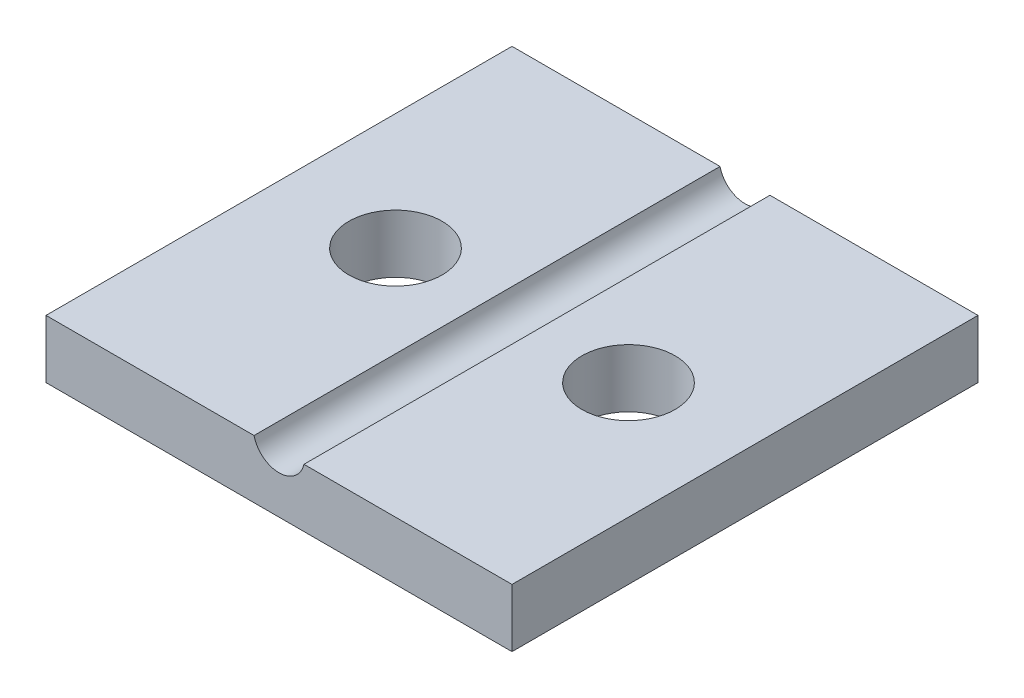
ISO-10303-21;
HEADER;
FILE_DESCRIPTION(('STEP AP214'),'2;1');
FILE_NAME('part.step','',(''),(''),'','','');
FILE_SCHEMA(('AUTOMOTIVE_DESIGN { 1 0 10303 214 1 1 1 1 }'));
ENDSEC;
DATA;
#1=APPLICATION_CONTEXT('core data for automotive mechanical design processes');
#2=APPLICATION_PROTOCOL_DEFINITION('international standard','automotive_design',2000,#1);
#3=PRODUCT_CONTEXT('',#1,'mechanical');
#4=PRODUCT('Part','Part','',(#3));
#5=PRODUCT_RELATED_PRODUCT_CATEGORY('part','',(#4));
#6=PRODUCT_DEFINITION_FORMATION('','',#4);
#7=PRODUCT_DEFINITION_CONTEXT('part definition',#1,'design');
#8=PRODUCT_DEFINITION('design','',#6,#7);
#9=PRODUCT_DEFINITION_SHAPE('','',#8);
#10=(LENGTH_UNIT() NAMED_UNIT(*) SI_UNIT(.MILLI.,.METRE.));
#11=(NAMED_UNIT(*) PLANE_ANGLE_UNIT() SI_UNIT($,.RADIAN.));
#12=(NAMED_UNIT(*) SI_UNIT($,.STERADIAN.) SOLID_ANGLE_UNIT());
#13=UNCERTAINTY_MEASURE_WITH_UNIT(LENGTH_MEASURE(1.E-05),#10,'distance_accuracy_value','');
#14=(GEOMETRIC_REPRESENTATION_CONTEXT(3) GLOBAL_UNCERTAINTY_ASSIGNED_CONTEXT((#13)) GLOBAL_UNIT_ASSIGNED_CONTEXT((#10,
#11,#12)) REPRESENTATION_CONTEXT('',''));
#15=CARTESIAN_POINT('',(0.,0.,0.));
#16=DIRECTION('',(0.,0.,1.));
#17=DIRECTION('',(1.,0.,0.));
#18=AXIS2_PLACEMENT_3D('',#15,#16,#17);
#19=CARTESIAN_POINT('',(0.,2.5,0.));
#20=DIRECTION('',(0.,1.,0.));
#21=DIRECTION('',(0.,0.,1.));
#22=AXIS2_PLACEMENT_3D('',#19,#20,#21);
#23=PLANE('',#22);
#24=CARTESIAN_POINT('',(-55.7547169811321,2.5,-42.0754716981132));
#25=DIRECTION('',(0.,1.,0.));
#26=DIRECTION('',(0.,0.,1.));
#27=AXIS2_PLACEMENT_3D('',#24,#25,#26);
#28=CIRCLE('',#27,2.);
#29=CARTESIAN_POINT('',(-55.7547169811321,2.5,-40.0754716981132));
#30=VERTEX_POINT('',#29);
#31=EDGE_CURVE('E170',#30,#30,#28,.T.);
#32=ORIENTED_EDGE('',*,*,#31,.F.);
#33=EDGE_LOOP('',(#32));
#34=FACE_BOUND('',#33,.T.);
#35=DIRECTION('',(0.,0.,1.));
#36=VECTOR('',#35,1.);
#37=CARTESIAN_POINT('',(-51.8259312454135,2.5,-52.0754716981132));
#38=LINE('',#37,#36);
#39=CARTESIAN_POINT('',(-51.8259312454135,2.5,-52.0754716981132));
#40=VERTEX_POINT('',#39);
#41=CARTESIAN_POINT('',(-51.8259312454135,2.5,-32.0754716981132));
#42=VERTEX_POINT('',#41);
#43=EDGE_CURVE('E11',#40,#42,#38,.T.);
#44=ORIENTED_EDGE('',*,*,#43,.F.);
#45=DIRECTION('',(-1.,0.,0.));
#46=VECTOR('',#45,1.);
#47=CARTESIAN_POINT('',(-60.7547169811321,2.5,-52.0754716981132));
#48=LINE('',#47,#46);
#49=CARTESIAN_POINT('',(-60.7547169811321,2.5,-52.0754716981132));
#50=VERTEX_POINT('',#49);
#51=EDGE_CURVE('E56',#40,#50,#48,.T.);
#52=ORIENTED_EDGE('',*,*,#51,.T.);
#53=DIRECTION('',(0.,0.,1.));
#54=VECTOR('',#53,1.);
#55=CARTESIAN_POINT('',(-60.7547169811321,2.5,-52.0754716981132));
#56=LINE('',#55,#54);
#57=CARTESIAN_POINT('',(-60.7547169811321,2.5,-32.0754716981132));
#58=VERTEX_POINT('',#57);
#59=EDGE_CURVE('E103',#50,#58,#56,.T.);
#60=ORIENTED_EDGE('',*,*,#59,.T.);
#61=DIRECTION('',(1.,0.,0.));
#62=VECTOR('',#61,1.);
#63=CARTESIAN_POINT('',(-60.7547169811321,2.5,-32.0754716981132));
#64=LINE('',#63,#62);
#65=EDGE_CURVE('E85',#58,#42,#64,.T.);
#66=ORIENTED_EDGE('',*,*,#65,.T.);
#67=EDGE_LOOP('',(#44,#52,#60,#66));
#68=FACE_BOUND('',#67,.T.);
#69=ADVANCED_FACE('F33',(#34,#68),#23,.T.);
#70=CARTESIAN_POINT('',(-60.7547169811321,2.5,-52.0754716981132));
#71=DIRECTION('',(1.,0.,0.));
#72=DIRECTION('',(0.,0.,-1.));
#73=AXIS2_PLACEMENT_3D('',#70,#71,#72);
#74=PLANE('',#73);
#75=DIRECTION('',(0.,0.,1.));
#76=VECTOR('',#75,1.);
#77=CARTESIAN_POINT('',(-60.7547169811321,0.,-52.0754716981132));
#78=LINE('',#77,#76);
#79=CARTESIAN_POINT('',(-60.7547169811321,0.,-52.0754716981132));
#80=VERTEX_POINT('',#79);
#81=CARTESIAN_POINT('',(-60.7547169811321,0.,-32.0754716981132));
#82=VERTEX_POINT('',#81);
#83=EDGE_CURVE('E114',#80,#82,#78,.T.);
#84=ORIENTED_EDGE('',*,*,#83,.T.);
#85=DIRECTION('',(0.,-1.,0.));
#86=VECTOR('',#85,1.);
#87=CARTESIAN_POINT('',(-60.7547169811321,2.5,-32.0754716981132));
#88=LINE('',#87,#86);
#89=EDGE_CURVE('E128',#58,#82,#88,.T.);
#90=ORIENTED_EDGE('',*,*,#89,.F.);
#91=ORIENTED_EDGE('',*,*,#59,.F.);
#92=DIRECTION('',(0.,-1.,0.));
#93=VECTOR('',#92,1.);
#94=CARTESIAN_POINT('',(-60.7547169811321,2.5,-52.0754716981132));
#95=LINE('',#94,#93);
#96=EDGE_CURVE('E113',#50,#80,#95,.T.);
#97=ORIENTED_EDGE('',*,*,#96,.T.);
#98=EDGE_LOOP('',(#84,#90,#91,#97));
#99=FACE_BOUND('',#98,.T.);
#100=ADVANCED_FACE('F35',(#99),#74,.F.);
#101=CARTESIAN_POINT('',(-60.7547169811321,2.5,-32.0754716981132));
#102=DIRECTION('',(0.,0.,-1.));
#103=DIRECTION('',(-1.,0.,0.));
#104=AXIS2_PLACEMENT_3D('',#101,#102,#103);
#105=PLANE('',#104);
#106=CARTESIAN_POINT('',(-49.6835027168507,2.5,-32.0754716981132));
#107=VERTEX_POINT('',#106);
#108=CARTESIAN_POINT('',(-40.7547169811321,2.5,-32.0754716981132));
#109=VERTEX_POINT('',#108);
#110=EDGE_CURVE('E99',#107,#109,#64,.T.);
#111=ORIENTED_EDGE('',*,*,#110,.F.);
#112=CARTESIAN_POINT('',(-50.7547169811321,2.75,-32.0754716981132));
#113=DIRECTION('',(0.,0.,1.));
#114=DIRECTION('',(1.,0.,0.));
#115=AXIS2_PLACEMENT_3D('',#112,#113,#114);
#116=CIRCLE('',#115,1.1);
#117=EDGE_CURVE('E47',#42,#107,#116,.T.);
#118=ORIENTED_EDGE('',*,*,#117,.F.);
#119=ORIENTED_EDGE('',*,*,#65,.F.);
#120=ORIENTED_EDGE('',*,*,#89,.T.);
#121=DIRECTION('',(1.,0.,0.));
#122=VECTOR('',#121,1.);
#123=CARTESIAN_POINT('',(-60.7547169811321,0.,-32.0754716981132));
#124=LINE('',#123,#122);
#125=CARTESIAN_POINT('',(-40.7547169811321,0.,-32.0754716981132));
#126=VERTEX_POINT('',#125);
#127=EDGE_CURVE('E117',#82,#126,#124,.T.);
#128=ORIENTED_EDGE('',*,*,#127,.T.);
#129=DIRECTION('',(0.,-1.,0.));
#130=VECTOR('',#129,1.);
#131=CARTESIAN_POINT('',(-40.7547169811321,2.5,-32.0754716981132));
#132=LINE('',#131,#130);
#133=EDGE_CURVE('E125',#109,#126,#132,.T.);
#134=ORIENTED_EDGE('',*,*,#133,.F.);
#135=EDGE_LOOP('',(#111,#118,#119,#120,#128,#134));
#136=FACE_BOUND('',#135,.T.);
#137=ADVANCED_FACE('F97',(#136),#105,.F.);
#138=CARTESIAN_POINT('',(-40.7547169811321,2.5,-52.0754716981132));
#139=DIRECTION('',(-1.,0.,0.));
#140=DIRECTION('',(0.,0.,1.));
#141=AXIS2_PLACEMENT_3D('',#138,#139,#140);
#142=PLANE('',#141);
#143=DIRECTION('',(0.,0.,-1.));
#144=VECTOR('',#143,1.);
#145=CARTESIAN_POINT('',(-40.7547169811321,0.,-52.0754716981132));
#146=LINE('',#145,#144);
#147=CARTESIAN_POINT('',(-40.7547169811321,0.,-52.0754716981132));
#148=VERTEX_POINT('',#147);
#149=EDGE_CURVE('E119',#126,#148,#146,.T.);
#150=ORIENTED_EDGE('',*,*,#149,.T.);
#151=DIRECTION('',(0.,-1.,0.));
#152=VECTOR('',#151,1.);
#153=CARTESIAN_POINT('',(-40.7547169811321,2.5,-52.0754716981132));
#154=LINE('',#153,#152);
#155=CARTESIAN_POINT('',(-40.7547169811321,2.5,-52.0754716981132));
#156=VERTEX_POINT('',#155);
#157=EDGE_CURVE('E123',#156,#148,#154,.T.);
#158=ORIENTED_EDGE('',*,*,#157,.F.);
#159=DIRECTION('',(0.,0.,-1.));
#160=VECTOR('',#159,1.);
#161=CARTESIAN_POINT('',(-40.7547169811321,2.5,-52.0754716981132));
#162=LINE('',#161,#160);
#163=EDGE_CURVE('E105',#109,#156,#162,.T.);
#164=ORIENTED_EDGE('',*,*,#163,.F.);
#165=ORIENTED_EDGE('',*,*,#133,.T.);
#166=EDGE_LOOP('',(#150,#158,#164,#165));
#167=FACE_BOUND('',#166,.T.);
#168=ADVANCED_FACE('F137',(#167),#142,.F.);
#169=CARTESIAN_POINT('',(-60.7547169811321,2.5,-52.0754716981132));
#170=DIRECTION('',(0.,0.,1.));
#171=DIRECTION('',(1.,0.,0.));
#172=AXIS2_PLACEMENT_3D('',#169,#170,#171);
#173=PLANE('',#172);
#174=ORIENTED_EDGE('',*,*,#51,.F.);
#175=CARTESIAN_POINT('',(-50.7547169811321,2.75,-52.0754716981132));
#176=DIRECTION('',(0.,0.,1.));
#177=DIRECTION('',(1.,0.,0.));
#178=AXIS2_PLACEMENT_3D('',#175,#176,#177);
#179=CIRCLE('',#178,1.1);
#180=CARTESIAN_POINT('',(-49.6835027168507,2.5,-52.0754716981132));
#181=VERTEX_POINT('',#180);
#182=EDGE_CURVE('E95',#40,#181,#179,.T.);
#183=ORIENTED_EDGE('',*,*,#182,.T.);
#184=EDGE_CURVE('E110',#156,#181,#48,.T.);
#185=ORIENTED_EDGE('',*,*,#184,.F.);
#186=ORIENTED_EDGE('',*,*,#157,.T.);
#187=DIRECTION('',(-1.,0.,0.));
#188=VECTOR('',#187,1.);
#189=CARTESIAN_POINT('',(-60.7547169811321,0.,-52.0754716981132));
#190=LINE('',#189,#188);
#191=EDGE_CURVE('E78',#148,#80,#190,.T.);
#192=ORIENTED_EDGE('',*,*,#191,.T.);
#193=ORIENTED_EDGE('',*,*,#96,.F.);
#194=EDGE_LOOP('',(#174,#183,#185,#186,#192,#193));
#195=FACE_BOUND('',#194,.T.);
#196=ADVANCED_FACE('F131',(#195),#173,.F.);
#197=CARTESIAN_POINT('',(-45.7547169811321,2.5,-42.0754716981132));
#198=DIRECTION('',(0.,1.,0.));
#199=DIRECTION('',(0.,0.,1.));
#200=AXIS2_PLACEMENT_3D('',#197,#198,#199);
#201=CIRCLE('',#200,2.);
#202=CARTESIAN_POINT('',(-45.7547169811321,2.5,-40.0754716981132));
#203=VERTEX_POINT('',#202);
#204=EDGE_CURVE('E165',#203,#203,#201,.T.);
#205=ORIENTED_EDGE('',*,*,#204,.F.);
#206=EDGE_LOOP('',(#205));
#207=FACE_BOUND('',#206,.T.);
#208=DIRECTION('',(0.,0.,1.));
#209=VECTOR('',#208,1.);
#210=CARTESIAN_POINT('',(-49.6835027168507,2.5,-52.0754716981132));
#211=LINE('',#210,#209);
#212=EDGE_CURVE('E41',#107,#181,#211,.F.);
#213=ORIENTED_EDGE('',*,*,#212,.F.);
#214=ORIENTED_EDGE('',*,*,#110,.T.);
#215=ORIENTED_EDGE('',*,*,#163,.T.);
#216=ORIENTED_EDGE('',*,*,#184,.T.);
#217=EDGE_LOOP('',(#213,#214,#215,#216));
#218=FACE_BOUND('',#217,.T.);
#219=ADVANCED_FACE('F133',(#207,#218),#23,.T.);
#220=CARTESIAN_POINT('',(0.,0.,0.));
#221=DIRECTION('',(0.,1.,0.));
#222=DIRECTION('',(0.,0.,1.));
#223=AXIS2_PLACEMENT_3D('',#220,#221,#222);
#224=PLANE('',#223);
#225=CARTESIAN_POINT('',(-45.7547169811321,0.,-42.0754716981132));
#226=DIRECTION('',(0.,1.,0.));
#227=DIRECTION('',(0.,0.,1.));
#228=AXIS2_PLACEMENT_3D('',#225,#226,#227);
#229=CIRCLE('',#228,2.);
#230=CARTESIAN_POINT('',(-45.7547169811321,0.,-40.0754716981132));
#231=VERTEX_POINT('',#230);
#232=EDGE_CURVE('E167',#231,#231,#229,.T.);
#233=ORIENTED_EDGE('',*,*,#232,.T.);
#234=EDGE_LOOP('',(#233));
#235=FACE_BOUND('',#234,.T.);
#236=CARTESIAN_POINT('',(-55.7547169811321,0.,-42.0754716981132));
#237=DIRECTION('',(0.,1.,0.));
#238=DIRECTION('',(0.,0.,1.));
#239=AXIS2_PLACEMENT_3D('',#236,#237,#238);
#240=CIRCLE('',#239,2.);
#241=CARTESIAN_POINT('',(-55.7547169811321,0.,-40.0754716981132));
#242=VERTEX_POINT('',#241);
#243=EDGE_CURVE('E100',#242,#242,#240,.T.);
#244=ORIENTED_EDGE('',*,*,#243,.T.);
#245=EDGE_LOOP('',(#244));
#246=FACE_BOUND('',#245,.T.);
#247=ORIENTED_EDGE('',*,*,#83,.F.);
#248=ORIENTED_EDGE('',*,*,#191,.F.);
#249=ORIENTED_EDGE('',*,*,#149,.F.);
#250=ORIENTED_EDGE('',*,*,#127,.F.);
#251=EDGE_LOOP('',(#247,#248,#249,#250));
#252=FACE_BOUND('',#251,.T.);
#253=ADVANCED_FACE('F141',(#235,#246,#252),#224,.F.);
#254=CARTESIAN_POINT('',(-50.7547169811321,2.75,-52.0754716981132));
#255=DIRECTION('',(0.,0.,1.));
#256=DIRECTION('',(1.,0.,0.));
#257=AXIS2_PLACEMENT_3D('',#254,#255,#256);
#258=CYLINDRICAL_SURFACE('',#257,1.1);
#259=ORIENTED_EDGE('',*,*,#43,.T.);
#260=ORIENTED_EDGE('',*,*,#117,.T.);
#261=ORIENTED_EDGE('',*,*,#212,.T.);
#262=ORIENTED_EDGE('',*,*,#182,.F.);
#263=EDGE_LOOP('',(#259,#260,#261,#262));
#264=FACE_BOUND('',#263,.T.);
#265=ADVANCED_FACE('F93',(#264),#258,.F.);
#266=CARTESIAN_POINT('',(-55.7547169811321,0.,-42.0754716981132));
#267=DIRECTION('',(0.,1.,0.));
#268=DIRECTION('',(0.,0.,1.));
#269=AXIS2_PLACEMENT_3D('',#266,#267,#268);
#270=CYLINDRICAL_SURFACE('',#269,2.);
#271=ORIENTED_EDGE('',*,*,#243,.F.);
#272=EDGE_LOOP('',(#271));
#273=FACE_BOUND('',#272,.T.);
#274=ORIENTED_EDGE('',*,*,#31,.T.);
#275=EDGE_LOOP('',(#274));
#276=FACE_BOUND('',#275,.T.);
#277=ADVANCED_FACE('F177',(#273,#276),#270,.F.);
#278=CARTESIAN_POINT('',(-45.7547169811321,0.,-42.0754716981132));
#279=DIRECTION('',(0.,1.,0.));
#280=DIRECTION('',(0.,0.,1.));
#281=AXIS2_PLACEMENT_3D('',#278,#279,#280);
#282=CYLINDRICAL_SURFACE('',#281,2.);
#283=ORIENTED_EDGE('',*,*,#232,.F.);
#284=EDGE_LOOP('',(#283));
#285=FACE_BOUND('',#284,.T.);
#286=ORIENTED_EDGE('',*,*,#204,.T.);
#287=EDGE_LOOP('',(#286));
#288=FACE_BOUND('',#287,.T.);
#289=ADVANCED_FACE('F179',(#285,#288),#282,.F.);
#290=CLOSED_SHELL('',(#69,#100,#137,#168,#196,#219,#253,#265,#277,#289));
#291=MANIFOLD_SOLID_BREP('B2',#290);
#292=ADVANCED_BREP_SHAPE_REPRESENTATION('',(#18,#291),#14);
#293=SHAPE_DEFINITION_REPRESENTATION(#9,#292);
ENDSEC;
END-ISO-10303-21;
